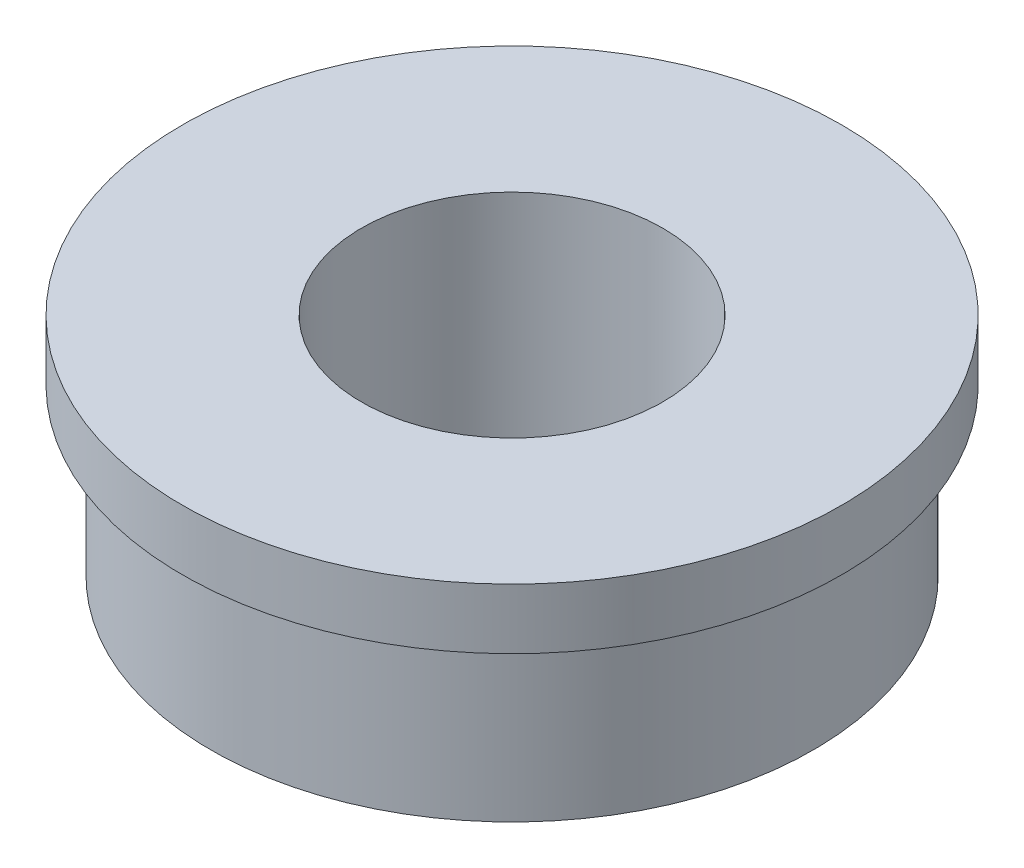
ISO-10303-21;
HEADER;
FILE_DESCRIPTION(('STEP AP214'),'2;1');
FILE_NAME('part.step','',(''),(''),'','','');
FILE_SCHEMA(('AUTOMOTIVE_DESIGN { 1 0 10303 214 1 1 1 1 }'));
ENDSEC;
DATA;
#1=APPLICATION_CONTEXT('core data for automotive mechanical design processes');
#2=APPLICATION_PROTOCOL_DEFINITION('international standard','automotive_design',2000,#1);
#3=PRODUCT_CONTEXT('',#1,'mechanical');
#4=PRODUCT('Part','Part','',(#3));
#5=PRODUCT_RELATED_PRODUCT_CATEGORY('part','',(#4));
#6=PRODUCT_DEFINITION_FORMATION('','',#4);
#7=PRODUCT_DEFINITION_CONTEXT('part definition',#1,'design');
#8=PRODUCT_DEFINITION('design','',#6,#7);
#9=PRODUCT_DEFINITION_SHAPE('','',#8);
#10=(LENGTH_UNIT() NAMED_UNIT(*) SI_UNIT(.MILLI.,.METRE.));
#11=(NAMED_UNIT(*) PLANE_ANGLE_UNIT() SI_UNIT($,.RADIAN.));
#12=(NAMED_UNIT(*) SI_UNIT($,.STERADIAN.) SOLID_ANGLE_UNIT());
#13=UNCERTAINTY_MEASURE_WITH_UNIT(LENGTH_MEASURE(1.E-05),#10,'distance_accuracy_value','');
#14=(GEOMETRIC_REPRESENTATION_CONTEXT(3) GLOBAL_UNCERTAINTY_ASSIGNED_CONTEXT((#13)) GLOBAL_UNIT_ASSIGNED_CONTEXT((#10,
#11,#12)) REPRESENTATION_CONTEXT('',''));
#15=CARTESIAN_POINT('',(0.,0.,0.));
#16=DIRECTION('',(0.,0.,1.));
#17=DIRECTION('',(1.,0.,0.));
#18=AXIS2_PLACEMENT_3D('',#15,#16,#17);
#19=CARTESIAN_POINT('',(0.,0.,0.));
#20=DIRECTION('',(0.,-1.,0.));
#21=DIRECTION('',(0.,0.,-1.));
#22=AXIS2_PLACEMENT_3D('',#19,#20,#21);
#23=CYLINDRICAL_SURFACE('',#22,3.175);
#24=CARTESIAN_POINT('',(0.,0.,0.));
#25=DIRECTION('',(0.,-1.,0.));
#26=DIRECTION('',(0.,0.,-1.));
#27=AXIS2_PLACEMENT_3D('',#24,#25,#26);
#28=CIRCLE('',#27,3.175);
#29=CARTESIAN_POINT('',(0.,0.,-3.175));
#30=VERTEX_POINT('',#29);
#31=EDGE_CURVE('E10',#30,#30,#28,.T.);
#32=ORIENTED_EDGE('',*,*,#31,.T.);
#33=EDGE_LOOP('',(#32));
#34=FACE_BOUND('',#33,.T.);
#35=CARTESIAN_POINT('',(0.,4.7625,0.));
#36=DIRECTION('',(0.,-1.,0.));
#37=DIRECTION('',(0.,0.,-1.));
#38=AXIS2_PLACEMENT_3D('',#35,#36,#37);
#39=CIRCLE('',#38,3.175);
#40=CARTESIAN_POINT('',(0.,4.7625,-3.175));
#41=VERTEX_POINT('',#40);
#42=EDGE_CURVE('E64',#41,#41,#39,.T.);
#43=ORIENTED_EDGE('',*,*,#42,.F.);
#44=EDGE_LOOP('',(#43));
#45=FACE_BOUND('',#44,.T.);
#46=ADVANCED_FACE('F37',(#34,#45),#23,.F.);
#47=CARTESIAN_POINT('',(0.,0.,-3.175));
#48=DIRECTION('',(0.,-1.,0.));
#49=DIRECTION('',(0.,0.,-1.));
#50=AXIS2_PLACEMENT_3D('',#47,#48,#49);
#51=PLANE('',#50);
#52=CARTESIAN_POINT('',(0.,0.,0.));
#53=DIRECTION('',(0.,-1.,0.));
#54=DIRECTION('',(0.,0.,-1.));
#55=AXIS2_PLACEMENT_3D('',#52,#53,#54);
#56=CIRCLE('',#55,6.35);
#57=CARTESIAN_POINT('',(0.,0.,-6.35));
#58=VERTEX_POINT('',#57);
#59=EDGE_CURVE('E44',#58,#58,#56,.T.);
#60=ORIENTED_EDGE('',*,*,#59,.T.);
#61=EDGE_LOOP('',(#60));
#62=FACE_BOUND('',#61,.T.);
#63=ORIENTED_EDGE('',*,*,#31,.F.);
#64=EDGE_LOOP('',(#63));
#65=FACE_BOUND('',#64,.T.);
#66=ADVANCED_FACE('F73',(#62,#65),#51,.T.);
#67=CARTESIAN_POINT('',(0.,0.,0.));
#68=DIRECTION('',(0.,-1.,0.));
#69=DIRECTION('',(0.,0.,-1.));
#70=AXIS2_PLACEMENT_3D('',#67,#68,#69);
#71=CYLINDRICAL_SURFACE('',#70,6.35);
#72=CARTESIAN_POINT('',(0.,3.4925,0.));
#73=DIRECTION('',(0.,-1.,0.));
#74=DIRECTION('',(0.,0.,-1.));
#75=AXIS2_PLACEMENT_3D('',#72,#73,#74);
#76=CIRCLE('',#75,6.35);
#77=CARTESIAN_POINT('',(0.,3.4925,-6.35));
#78=VERTEX_POINT('',#77);
#79=EDGE_CURVE('E49',#78,#78,#76,.T.);
#80=ORIENTED_EDGE('',*,*,#79,.T.);
#81=EDGE_LOOP('',(#80));
#82=FACE_BOUND('',#81,.T.);
#83=ORIENTED_EDGE('',*,*,#59,.F.);
#84=EDGE_LOOP('',(#83));
#85=FACE_BOUND('',#84,.T.);
#86=ADVANCED_FACE('F77',(#82,#85),#71,.T.);
#87=CARTESIAN_POINT('',(0.,3.4925,-6.35));
#88=DIRECTION('',(0.,-1.,0.));
#89=DIRECTION('',(0.,0.,-1.));
#90=AXIS2_PLACEMENT_3D('',#87,#88,#89);
#91=PLANE('',#90);
#92=CARTESIAN_POINT('',(0.,3.4925,0.));
#93=DIRECTION('',(0.,-1.,0.));
#94=DIRECTION('',(0.,0.,-1.));
#95=AXIS2_PLACEMENT_3D('',#92,#93,#94);
#96=CIRCLE('',#95,6.9453125);
#97=CARTESIAN_POINT('',(0.,3.4925,-6.9453125));
#98=VERTEX_POINT('',#97);
#99=EDGE_CURVE('E54',#98,#98,#96,.T.);
#100=ORIENTED_EDGE('',*,*,#99,.T.);
#101=EDGE_LOOP('',(#100));
#102=FACE_BOUND('',#101,.T.);
#103=ORIENTED_EDGE('',*,*,#79,.F.);
#104=EDGE_LOOP('',(#103));
#105=FACE_BOUND('',#104,.T.);
#106=ADVANCED_FACE('F81',(#102,#105),#91,.T.);
#107=CARTESIAN_POINT('',(0.,0.,0.));
#108=DIRECTION('',(0.,-1.,0.));
#109=DIRECTION('',(0.,0.,-1.));
#110=AXIS2_PLACEMENT_3D('',#107,#108,#109);
#111=CYLINDRICAL_SURFACE('',#110,6.9453125);
#112=CARTESIAN_POINT('',(0.,4.7625,0.));
#113=DIRECTION('',(0.,-1.,0.));
#114=DIRECTION('',(0.,0.,-1.));
#115=AXIS2_PLACEMENT_3D('',#112,#113,#114);
#116=CIRCLE('',#115,6.9453125);
#117=CARTESIAN_POINT('',(0.,4.7625,-6.9453125));
#118=VERTEX_POINT('',#117);
#119=EDGE_CURVE('E60',#118,#118,#116,.T.);
#120=ORIENTED_EDGE('',*,*,#119,.T.);
#121=EDGE_LOOP('',(#120));
#122=FACE_BOUND('',#121,.T.);
#123=ORIENTED_EDGE('',*,*,#99,.F.);
#124=EDGE_LOOP('',(#123));
#125=FACE_BOUND('',#124,.T.);
#126=ADVANCED_FACE('F88',(#122,#125),#111,.T.);
#127=CARTESIAN_POINT('',(0.,4.7625,-6.9453125));
#128=DIRECTION('',(0.,1.,0.));
#129=DIRECTION('',(0.,0.,1.));
#130=AXIS2_PLACEMENT_3D('',#127,#128,#129);
#131=PLANE('',#130);
#132=ORIENTED_EDGE('',*,*,#42,.T.);
#133=EDGE_LOOP('',(#132));
#134=FACE_BOUND('',#133,.T.);
#135=ORIENTED_EDGE('',*,*,#119,.F.);
#136=EDGE_LOOP('',(#135));
#137=FACE_BOUND('',#136,.T.);
#138=ADVANCED_FACE('F69',(#134,#137),#131,.T.);
#139=CLOSED_SHELL('',(#46,#66,#86,#106,#126,#138));
#140=MANIFOLD_SOLID_BREP('B2',#139);
#141=ADVANCED_BREP_SHAPE_REPRESENTATION('',(#18,#140),#14);
#142=SHAPE_DEFINITION_REPRESENTATION(#9,#141);
ENDSEC;
END-ISO-10303-21;
